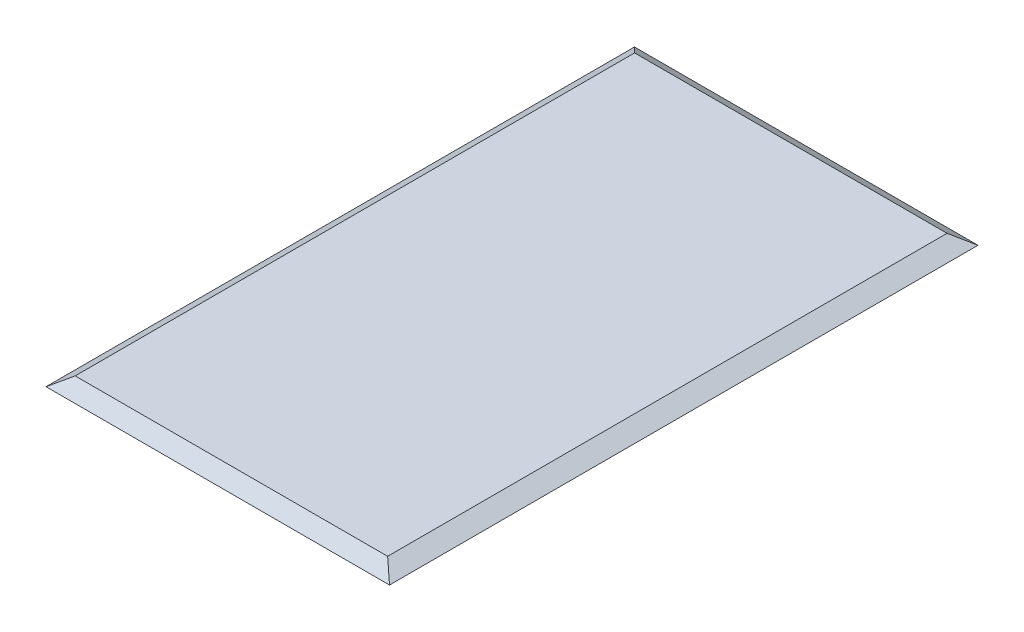
ISO-10303-21;
HEADER;
FILE_DESCRIPTION(('STEP AP214'),'2;1');
FILE_NAME('part.step','',(''),(''),'','','');
FILE_SCHEMA(('AUTOMOTIVE_DESIGN { 1 0 10303 214 1 1 1 1 }'));
ENDSEC;
DATA;
#1=APPLICATION_CONTEXT('core data for automotive mechanical design processes');
#2=APPLICATION_PROTOCOL_DEFINITION('international standard','automotive_design',2000,#1);
#3=PRODUCT_CONTEXT('',#1,'mechanical');
#4=PRODUCT('Part','Part','',(#3));
#5=PRODUCT_RELATED_PRODUCT_CATEGORY('part','',(#4));
#6=PRODUCT_DEFINITION_FORMATION('','',#4);
#7=PRODUCT_DEFINITION_CONTEXT('part definition',#1,'design');
#8=PRODUCT_DEFINITION('design','',#6,#7);
#9=PRODUCT_DEFINITION_SHAPE('','',#8);
#10=(LENGTH_UNIT() NAMED_UNIT(*) SI_UNIT(.MILLI.,.METRE.));
#11=(NAMED_UNIT(*) PLANE_ANGLE_UNIT() SI_UNIT($,.RADIAN.));
#12=(NAMED_UNIT(*) SI_UNIT($,.STERADIAN.) SOLID_ANGLE_UNIT());
#13=UNCERTAINTY_MEASURE_WITH_UNIT(LENGTH_MEASURE(1.E-05),#10,'distance_accuracy_value','');
#14=(GEOMETRIC_REPRESENTATION_CONTEXT(3) GLOBAL_UNCERTAINTY_ASSIGNED_CONTEXT((#13)) GLOBAL_UNIT_ASSIGNED_CONTEXT((#10,
#11,#12)) REPRESENTATION_CONTEXT('',''));
#15=CARTESIAN_POINT('',(0.,0.,0.));
#16=DIRECTION('',(0.,0.,1.));
#17=DIRECTION('',(1.,0.,0.));
#18=AXIS2_PLACEMENT_3D('',#15,#16,#17);
#19=CARTESIAN_POINT('',(0.,90.,0.));
#20=DIRECTION('',(0.,-1.,0.));
#21=DIRECTION('',(0.,0.,-1.));
#22=AXIS2_PLACEMENT_3D('',#19,#20,#21);
#23=PLANE('',#22);
#24=DIRECTION('',(0.,0.,1.));
#25=VECTOR('',#24,1.);
#26=CARTESIAN_POINT('',(3140.,90.,-5650.));
#27=LINE('',#26,#25);
#28=CARTESIAN_POINT('',(3140.,90.,-5510.89597638142));
#29=VERTEX_POINT('',#28);
#30=CARTESIAN_POINT('',(3140.,90.0000000000003,-140.000000000001));
#31=VERTEX_POINT('',#30);
#32=EDGE_CURVE('E146',#29,#31,#27,.T.);
#33=ORIENTED_EDGE('',*,*,#32,.F.);
#34=DIRECTION('',(-1.,0.,0.));
#35=VECTOR('',#34,1.);
#36=CARTESIAN_POINT('',(3298.06747049713,90.,-5510.89597638142));
#37=LINE('',#36,#35);
#38=CARTESIAN_POINT('',(140.000000000001,90.,-5510.89597638142));
#39=VERTEX_POINT('',#38);
#40=EDGE_CURVE('E139',#29,#39,#37,.T.);
#41=ORIENTED_EDGE('',*,*,#40,.T.);
#42=DIRECTION('',(0.,0.,1.));
#43=VECTOR('',#42,1.);
#44=CARTESIAN_POINT('',(140.,90.,-5650.));
#45=LINE('',#44,#43);
#46=CARTESIAN_POINT('',(140.,90.,-140.000000000001));
#47=VERTEX_POINT('',#46);
#48=EDGE_CURVE('E147',#39,#47,#45,.T.);
#49=ORIENTED_EDGE('',*,*,#48,.T.);
#50=DIRECTION('',(-1.,0.,0.));
#51=VECTOR('',#50,1.);
#52=CARTESIAN_POINT('',(3298.06747049713,90.,-140.));
#53=LINE('',#52,#51);
#54=EDGE_CURVE('E59',#31,#47,#53,.T.);
#55=ORIENTED_EDGE('',*,*,#54,.F.);
#56=EDGE_LOOP('',(#33,#41,#49,#55));
#57=FACE_BOUND('',#56,.T.);
#58=ADVANCED_FACE('F36',(#57),#23,.F.);
#59=CARTESIAN_POINT('',(0.,0.,0.));
#60=DIRECTION('',(0.,-1.,0.));
#61=DIRECTION('',(0.,0.,-1.));
#62=AXIS2_PLACEMENT_3D('',#59,#60,#61);
#63=PLANE('',#62);
#64=DIRECTION('',(0.,0.,-1.));
#65=VECTOR('',#64,1.);
#66=CARTESIAN_POINT('',(140.,0.,-140.));
#67=LINE('',#66,#65);
#68=CARTESIAN_POINT('',(140.,0.,-140.));
#69=VERTEX_POINT('',#68);
#70=CARTESIAN_POINT('',(140.,0.,-5530.));
#71=VERTEX_POINT('',#70);
#72=EDGE_CURVE('E51',#69,#71,#67,.T.);
#73=ORIENTED_EDGE('',*,*,#72,.F.);
#74=DIRECTION('',(-1.,0.,0.));
#75=VECTOR('',#74,1.);
#76=CARTESIAN_POINT('',(140.,0.,-140.));
#77=LINE('',#76,#75);
#78=CARTESIAN_POINT('',(3140.,0.,-140.));
#79=VERTEX_POINT('',#78);
#80=EDGE_CURVE('E120',#79,#69,#77,.T.);
#81=ORIENTED_EDGE('',*,*,#80,.F.);
#82=DIRECTION('',(0.,0.,1.));
#83=VECTOR('',#82,1.);
#84=CARTESIAN_POINT('',(3140.,0.,-140.));
#85=LINE('',#84,#83);
#86=CARTESIAN_POINT('',(3140.,0.,-5530.));
#87=VERTEX_POINT('',#86);
#88=EDGE_CURVE('E123',#87,#79,#85,.T.);
#89=ORIENTED_EDGE('',*,*,#88,.F.);
#90=DIRECTION('',(1.,0.,0.));
#91=VECTOR('',#90,1.);
#92=CARTESIAN_POINT('',(140.,0.,-5530.));
#93=LINE('',#92,#91);
#94=EDGE_CURVE('E129',#71,#87,#93,.T.);
#95=ORIENTED_EDGE('',*,*,#94,.F.);
#96=EDGE_LOOP('',(#73,#81,#89,#95));
#97=FACE_BOUND('',#96,.T.);
#98=DIRECTION('',(0.,0.,1.));
#99=VECTOR('',#98,1.);
#100=CARTESIAN_POINT('',(0.,0.,0.));
#101=LINE('',#100,#99);
#102=CARTESIAN_POINT('',(0.,0.,-5650.));
#103=VERTEX_POINT('',#102);
#104=CARTESIAN_POINT('',(0.,-2.22044604925031E-13,0.));
#105=VERTEX_POINT('',#104);
#106=EDGE_CURVE('E150',#103,#105,#101,.T.);
#107=ORIENTED_EDGE('',*,*,#106,.F.);
#108=DIRECTION('',(-1.,0.,0.));
#109=VECTOR('',#108,1.);
#110=CARTESIAN_POINT('',(0.,0.,-5650.));
#111=LINE('',#110,#109);
#112=CARTESIAN_POINT('',(3298.06747049713,0.,-5650.));
#113=VERTEX_POINT('',#112);
#114=EDGE_CURVE('E160',#113,#103,#111,.T.);
#115=ORIENTED_EDGE('',*,*,#114,.F.);
#116=DIRECTION('',(0.,0.,-1.));
#117=VECTOR('',#116,1.);
#118=CARTESIAN_POINT('',(3298.06747049713,0.,0.));
#119=LINE('',#118,#117);
#120=CARTESIAN_POINT('',(3298.06747049713,0.,0.));
#121=VERTEX_POINT('',#120);
#122=EDGE_CURVE('E157',#121,#113,#119,.T.);
#123=ORIENTED_EDGE('',*,*,#122,.F.);
#124=DIRECTION('',(1.,0.,0.));
#125=VECTOR('',#124,1.);
#126=CARTESIAN_POINT('',(0.,0.,0.));
#127=LINE('',#126,#125);
#128=EDGE_CURVE('E155',#105,#121,#127,.T.);
#129=ORIENTED_EDGE('',*,*,#128,.F.);
#130=EDGE_LOOP('',(#107,#115,#123,#129));
#131=FACE_BOUND('',#130,.T.);
#132=ADVANCED_FACE('F38',(#97,#131),#63,.T.);
#133=CARTESIAN_POINT('',(3140.,90.,-5650.));
#134=DIRECTION('',(0.494794433797288,0.869010050737747,0.));
#135=DIRECTION('',(-0.869010050737747,0.494794433797288,0.));
#136=AXIS2_PLACEMENT_3D('',#133,#134,#135);
#137=PLANE('',#136);
#138=DIRECTION('',(0.690288777581008,-0.393034631267909,-0.607474429231236));
#139=VECTOR('',#138,1.);
#140=CARTESIAN_POINT('',(3198.33087709533,56.7877336047165,-5562.22886403782));
#141=LINE('',#140,#139);
#142=EDGE_CURVE('E144',#29,#113,#141,.T.);
#143=ORIENTED_EDGE('',*,*,#142,.F.);
#144=ORIENTED_EDGE('',*,*,#32,.T.);
#145=DIRECTION('',(-0.68864860300915,0.39210075340548,-0.609934505297414));
#146=VECTOR('',#145,1.);
#147=CARTESIAN_POINT('',(825.631697049224,1407.74834259368,-2189.83075514573));
#148=LINE('',#147,#146);
#149=EDGE_CURVE('E142',#121,#31,#148,.T.);
#150=ORIENTED_EDGE('',*,*,#149,.F.);
#151=ORIENTED_EDGE('',*,*,#122,.T.);
#152=EDGE_LOOP('',(#143,#144,#150,#151));
#153=FACE_BOUND('',#152,.T.);
#154=ADVANCED_FACE('F174',(#153),#137,.T.);
#155=CARTESIAN_POINT('',(0.,0.,-5650.));
#156=DIRECTION('',(-0.540757591313499,0.841178475376554,0.));
#157=DIRECTION('',(-0.841178475376554,-0.540757591313499,0.));
#158=AXIS2_PLACEMENT_3D('',#155,#156,#157);
#159=PLANE('',#158);
#160=DIRECTION('',(0.64542910811409,0.414918712359058,0.641298470708727));
#161=VECTOR('',#160,1.);
#162=CARTESIAN_POINT('',(0.,0.,-5650.));
#163=LINE('',#162,#161);
#164=EDGE_CURVE('E12',#103,#39,#163,.T.);
#165=ORIENTED_EDGE('',*,*,#164,.F.);
#166=ORIENTED_EDGE('',*,*,#106,.T.);
#167=DIRECTION('',(-0.643720685820384,-0.413820440884533,0.643720685820384));
#168=VECTOR('',#167,1.);
#169=CARTESIAN_POINT('',(2341.22621564482,1505.07399577167,-2341.22621564482));
#170=LINE('',#169,#168);
#171=EDGE_CURVE('E44',#47,#105,#170,.T.);
#172=ORIENTED_EDGE('',*,*,#171,.F.);
#173=ORIENTED_EDGE('',*,*,#48,.F.);
#174=EDGE_LOOP('',(#165,#166,#172,#173));
#175=FACE_BOUND('',#174,.T.);
#176=ADVANCED_FACE('F168',(#175),#159,.T.);
#177=CARTESIAN_POINT('',(3298.06747049713,0.,0.));
#178=DIRECTION('',(0.,-0.841178475376554,-0.540757591313499));
#179=DIRECTION('',(0.,0.540757591313499,-0.841178475376554));
#180=AXIS2_PLACEMENT_3D('',#177,#178,#179);
#181=PLANE('',#180);
#182=ORIENTED_EDGE('',*,*,#149,.T.);
#183=ORIENTED_EDGE('',*,*,#54,.T.);
#184=ORIENTED_EDGE('',*,*,#171,.T.);
#185=ORIENTED_EDGE('',*,*,#128,.T.);
#186=EDGE_LOOP('',(#182,#183,#184,#185));
#187=FACE_BOUND('',#186,.T.);
#188=ADVANCED_FACE('F161',(#187),#181,.F.);
#189=CARTESIAN_POINT('',(3298.06747049713,90.,-5510.89597638142));
#190=DIRECTION('',(0.,-0.839593516952168,0.543215174946254));
#191=DIRECTION('',(0.,-0.543215174946254,-0.839593516952168));
#192=AXIS2_PLACEMENT_3D('',#189,#190,#191);
#193=PLANE('',#192);
#194=ORIENTED_EDGE('',*,*,#142,.T.);
#195=ORIENTED_EDGE('',*,*,#114,.T.);
#196=ORIENTED_EDGE('',*,*,#164,.T.);
#197=ORIENTED_EDGE('',*,*,#40,.F.);
#198=EDGE_LOOP('',(#194,#195,#196,#197));
#199=FACE_BOUND('',#198,.T.);
#200=ADVANCED_FACE('F178',(#199),#193,.F.);
#201=CARTESIAN_POINT('',(140.,60.,-140.));
#202=DIRECTION('',(-1.,0.,0.));
#203=DIRECTION('',(0.,0.,1.));
#204=AXIS2_PLACEMENT_3D('',#201,#202,#203);
#205=PLANE('',#204);
#206=ORIENTED_EDGE('',*,*,#72,.T.);
#207=DIRECTION('',(0.,-1.,0.));
#208=VECTOR('',#207,1.);
#209=CARTESIAN_POINT('',(140.,60.,-5530.));
#210=LINE('',#209,#208);
#211=CARTESIAN_POINT('',(140.,60.,-5530.));
#212=VERTEX_POINT('',#211);
#213=EDGE_CURVE('E98',#212,#71,#210,.T.);
#214=ORIENTED_EDGE('',*,*,#213,.F.);
#215=DIRECTION('',(0.,0.,-1.));
#216=VECTOR('',#215,1.);
#217=CARTESIAN_POINT('',(140.,60.,-140.));
#218=LINE('',#217,#216);
#219=CARTESIAN_POINT('',(140.,60.,-140.));
#220=VERTEX_POINT('',#219);
#221=EDGE_CURVE('E102',#220,#212,#218,.T.);
#222=ORIENTED_EDGE('',*,*,#221,.F.);
#223=DIRECTION('',(0.,-1.,0.));
#224=VECTOR('',#223,1.);
#225=CARTESIAN_POINT('',(140.,60.,-140.));
#226=LINE('',#225,#224);
#227=EDGE_CURVE('E133',#220,#69,#226,.T.);
#228=ORIENTED_EDGE('',*,*,#227,.T.);
#229=EDGE_LOOP('',(#206,#214,#222,#228));
#230=FACE_BOUND('',#229,.T.);
#231=ADVANCED_FACE('F100',(#230),#205,.F.);
#232=CARTESIAN_POINT('',(140.,60.,-140.));
#233=DIRECTION('',(0.,0.,1.));
#234=DIRECTION('',(1.,0.,0.));
#235=AXIS2_PLACEMENT_3D('',#232,#233,#234);
#236=PLANE('',#235);
#237=ORIENTED_EDGE('',*,*,#80,.T.);
#238=ORIENTED_EDGE('',*,*,#227,.F.);
#239=DIRECTION('',(-1.,0.,0.));
#240=VECTOR('',#239,1.);
#241=CARTESIAN_POINT('',(140.,60.,-140.));
#242=LINE('',#241,#240);
#243=CARTESIAN_POINT('',(3140.,60.,-140.));
#244=VERTEX_POINT('',#243);
#245=EDGE_CURVE('E108',#244,#220,#242,.T.);
#246=ORIENTED_EDGE('',*,*,#245,.F.);
#247=DIRECTION('',(0.,-1.,0.));
#248=VECTOR('',#247,1.);
#249=CARTESIAN_POINT('',(3140.,60.,-140.));
#250=LINE('',#249,#248);
#251=EDGE_CURVE('E135',#244,#79,#250,.T.);
#252=ORIENTED_EDGE('',*,*,#251,.T.);
#253=EDGE_LOOP('',(#237,#238,#246,#252));
#254=FACE_BOUND('',#253,.T.);
#255=ADVANCED_FACE('F185',(#254),#236,.F.);
#256=CARTESIAN_POINT('',(3140.,60.,-140.));
#257=DIRECTION('',(1.,0.,0.));
#258=DIRECTION('',(0.,0.,-1.));
#259=AXIS2_PLACEMENT_3D('',#256,#257,#258);
#260=PLANE('',#259);
#261=ORIENTED_EDGE('',*,*,#88,.T.);
#262=ORIENTED_EDGE('',*,*,#251,.F.);
#263=DIRECTION('',(0.,0.,1.));
#264=VECTOR('',#263,1.);
#265=CARTESIAN_POINT('',(3140.,60.,-140.));
#266=LINE('',#265,#264);
#267=CARTESIAN_POINT('',(3140.,60.,-5530.));
#268=VERTEX_POINT('',#267);
#269=EDGE_CURVE('E116',#268,#244,#266,.T.);
#270=ORIENTED_EDGE('',*,*,#269,.F.);
#271=DIRECTION('',(0.,-1.,0.));
#272=VECTOR('',#271,1.);
#273=CARTESIAN_POINT('',(3140.,60.,-5530.));
#274=LINE('',#273,#272);
#275=EDGE_CURVE('E107',#268,#87,#274,.T.);
#276=ORIENTED_EDGE('',*,*,#275,.T.);
#277=EDGE_LOOP('',(#261,#262,#270,#276));
#278=FACE_BOUND('',#277,.T.);
#279=ADVANCED_FACE('F231',(#278),#260,.F.);
#280=CARTESIAN_POINT('',(140.,60.,-5530.));
#281=DIRECTION('',(0.,0.,-1.));
#282=DIRECTION('',(-1.,0.,0.));
#283=AXIS2_PLACEMENT_3D('',#280,#281,#282);
#284=PLANE('',#283);
#285=ORIENTED_EDGE('',*,*,#94,.T.);
#286=ORIENTED_EDGE('',*,*,#275,.F.);
#287=DIRECTION('',(1.,0.,0.));
#288=VECTOR('',#287,1.);
#289=CARTESIAN_POINT('',(140.,60.,-5530.));
#290=LINE('',#289,#288);
#291=EDGE_CURVE('E111',#212,#268,#290,.T.);
#292=ORIENTED_EDGE('',*,*,#291,.F.);
#293=ORIENTED_EDGE('',*,*,#213,.T.);
#294=EDGE_LOOP('',(#285,#286,#292,#293));
#295=FACE_BOUND('',#294,.T.);
#296=ADVANCED_FACE('F112',(#295),#284,.F.);
#297=CARTESIAN_POINT('',(0.,60.,0.));
#298=DIRECTION('',(0.,-1.,0.));
#299=DIRECTION('',(0.,0.,-1.));
#300=AXIS2_PLACEMENT_3D('',#297,#298,#299);
#301=PLANE('',#300);
#302=ORIENTED_EDGE('',*,*,#221,.T.);
#303=ORIENTED_EDGE('',*,*,#291,.T.);
#304=ORIENTED_EDGE('',*,*,#269,.T.);
#305=ORIENTED_EDGE('',*,*,#245,.T.);
#306=EDGE_LOOP('',(#302,#303,#304,#305));
#307=FACE_BOUND('',#306,.T.);
#308=ADVANCED_FACE('F118',(#307),#301,.T.);
#309=CLOSED_SHELL('',(#58,#132,#154,#176,#188,#200,#231,#255,#279,#296,#308));
#310=MANIFOLD_SOLID_BREP('B2',#309);
#311=ADVANCED_BREP_SHAPE_REPRESENTATION('',(#18,#310),#14);
#312=SHAPE_DEFINITION_REPRESENTATION(#9,#311);
ENDSEC;
END-ISO-10303-21;
